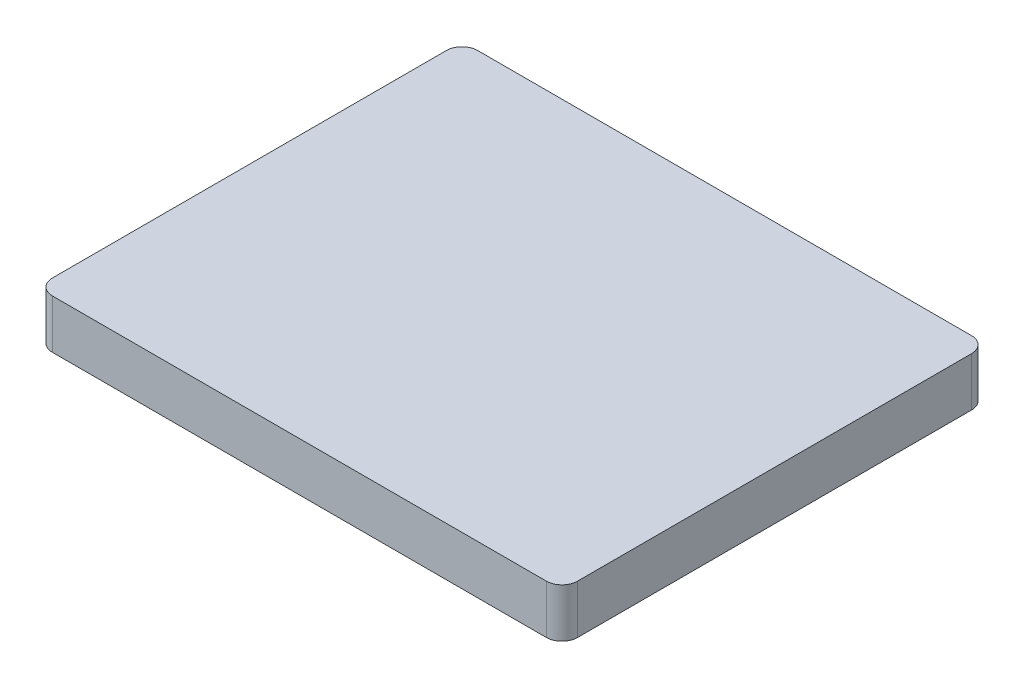
ISO-10303-21;
HEADER;
FILE_DESCRIPTION(('STEP AP214'),'2;1');
FILE_NAME('part.step','',(''),(''),'','','');
FILE_SCHEMA(('AUTOMOTIVE_DESIGN { 1 0 10303 214 1 1 1 1 }'));
ENDSEC;
DATA;
#1=APPLICATION_CONTEXT('core data for automotive mechanical design processes');
#2=APPLICATION_PROTOCOL_DEFINITION('international standard','automotive_design',2000,#1);
#3=PRODUCT_CONTEXT('',#1,'mechanical');
#4=PRODUCT('Part','Part','',(#3));
#5=PRODUCT_RELATED_PRODUCT_CATEGORY('part','',(#4));
#6=PRODUCT_DEFINITION_FORMATION('','',#4);
#7=PRODUCT_DEFINITION_CONTEXT('part definition',#1,'design');
#8=PRODUCT_DEFINITION('design','',#6,#7);
#9=PRODUCT_DEFINITION_SHAPE('','',#8);
#10=(LENGTH_UNIT() NAMED_UNIT(*) SI_UNIT(.MILLI.,.METRE.));
#11=(NAMED_UNIT(*) PLANE_ANGLE_UNIT() SI_UNIT($,.RADIAN.));
#12=(NAMED_UNIT(*) SI_UNIT($,.STERADIAN.) SOLID_ANGLE_UNIT());
#13=UNCERTAINTY_MEASURE_WITH_UNIT(LENGTH_MEASURE(1.E-05),#10,'distance_accuracy_value','');
#14=(GEOMETRIC_REPRESENTATION_CONTEXT(3) GLOBAL_UNCERTAINTY_ASSIGNED_CONTEXT((#13)) GLOBAL_UNIT_ASSIGNED_CONTEXT((#10,
#11,#12)) REPRESENTATION_CONTEXT('',''));
#15=CARTESIAN_POINT('',(0.,0.,0.));
#16=DIRECTION('',(0.,0.,1.));
#17=DIRECTION('',(1.,0.,0.));
#18=AXIS2_PLACEMENT_3D('',#15,#16,#17);
#19=CARTESIAN_POINT('',(10.875,17.7531010026189,8.375));
#20=DIRECTION('',(0.,1.,0.));
#21=DIRECTION('',(0.,0.,1.));
#22=AXIS2_PLACEMENT_3D('',#19,#20,#21);
#23=CYLINDRICAL_SURFACE('',#22,0.7);
#24=DIRECTION('',(0.,1.,0.));
#25=VECTOR('',#24,1.);
#26=CARTESIAN_POINT('',(10.875,17.7531010026189,9.075));
#27=LINE('',#26,#25);
#28=CARTESIAN_POINT('',(10.875,18.,9.075));
#29=VERTEX_POINT('',#28);
#30=CARTESIAN_POINT('',(10.875,20.2,9.075));
#31=VERTEX_POINT('',#30);
#32=EDGE_CURVE('E163',#29,#31,#27,.T.);
#33=ORIENTED_EDGE('',*,*,#32,.F.);
#34=CARTESIAN_POINT('',(10.875,18.,8.375));
#35=DIRECTION('',(0.,1.,0.));
#36=DIRECTION('',(0.,0.,1.));
#37=AXIS2_PLACEMENT_3D('',#34,#35,#36);
#38=CIRCLE('',#37,0.7);
#39=CARTESIAN_POINT('',(11.575,18.,8.375));
#40=VERTEX_POINT('',#39);
#41=EDGE_CURVE('E156',#29,#40,#38,.T.);
#42=ORIENTED_EDGE('',*,*,#41,.T.);
#43=DIRECTION('',(0.,1.,0.));
#44=VECTOR('',#43,1.);
#45=CARTESIAN_POINT('',(11.575,17.7531010026189,8.375));
#46=LINE('',#45,#44);
#47=CARTESIAN_POINT('',(11.575,20.2,8.375));
#48=VERTEX_POINT('',#47);
#49=EDGE_CURVE('E11',#40,#48,#46,.T.);
#50=ORIENTED_EDGE('',*,*,#49,.T.);
#51=CARTESIAN_POINT('',(10.875,20.2,8.375));
#52=DIRECTION('',(0.,1.,0.));
#53=DIRECTION('',(0.,0.,1.));
#54=AXIS2_PLACEMENT_3D('',#51,#52,#53);
#55=CIRCLE('',#54,0.7);
#56=EDGE_CURVE('E134',#48,#31,#55,.F.);
#57=ORIENTED_EDGE('',*,*,#56,.T.);
#58=EDGE_LOOP('',(#33,#42,#50,#57));
#59=FACE_BOUND('',#58,.T.);
#60=ADVANCED_FACE('F45',(#59),#23,.T.);
#61=CARTESIAN_POINT('',(-11.375,17.7531010026189,9.075));
#62=DIRECTION('',(0.,0.,1.));
#63=DIRECTION('',(1.,0.,0.));
#64=AXIS2_PLACEMENT_3D('',#61,#62,#63);
#65=PLANE('',#64);
#66=DIRECTION('',(0.,1.,0.));
#67=VECTOR('',#66,1.);
#68=CARTESIAN_POINT('',(-11.375,17.7531010026189,9.075));
#69=LINE('',#68,#67);
#70=CARTESIAN_POINT('',(-11.375,18.,9.075));
#71=VERTEX_POINT('',#70);
#72=CARTESIAN_POINT('',(-11.375,20.2,9.075));
#73=VERTEX_POINT('',#72);
#74=EDGE_CURVE('E166',#71,#73,#69,.T.);
#75=ORIENTED_EDGE('',*,*,#74,.F.);
#76=DIRECTION('',(1.,0.,0.));
#77=VECTOR('',#76,1.);
#78=CARTESIAN_POINT('',(0.,18.,9.075));
#79=LINE('',#78,#77);
#80=EDGE_CURVE('E152',#71,#29,#79,.T.);
#81=ORIENTED_EDGE('',*,*,#80,.T.);
#82=ORIENTED_EDGE('',*,*,#32,.T.);
#83=DIRECTION('',(-1.,0.,0.));
#84=VECTOR('',#83,1.);
#85=CARTESIAN_POINT('',(-0.25,20.2,9.075));
#86=LINE('',#85,#84);
#87=EDGE_CURVE('E138',#31,#73,#86,.T.);
#88=ORIENTED_EDGE('',*,*,#87,.T.);
#89=EDGE_LOOP('',(#75,#81,#82,#88));
#90=FACE_BOUND('',#89,.T.);
#91=ADVANCED_FACE('F220',(#90),#65,.T.);
#92=CARTESIAN_POINT('',(11.575,17.7531010026189,-9.375));
#93=DIRECTION('',(1.,0.,0.));
#94=DIRECTION('',(0.,0.,-1.));
#95=AXIS2_PLACEMENT_3D('',#92,#93,#94);
#96=PLANE('',#95);
#97=ORIENTED_EDGE('',*,*,#49,.F.);
#98=DIRECTION('',(0.,0.,-1.));
#99=VECTOR('',#98,1.);
#100=CARTESIAN_POINT('',(11.575,18.,0.));
#101=LINE('',#100,#99);
#102=CARTESIAN_POINT('',(11.575,18.,-9.375));
#103=VERTEX_POINT('',#102);
#104=EDGE_CURVE('E160',#40,#103,#101,.T.);
#105=ORIENTED_EDGE('',*,*,#104,.T.);
#106=DIRECTION('',(0.,1.,0.));
#107=VECTOR('',#106,1.);
#108=CARTESIAN_POINT('',(11.575,17.7531010026189,-9.375));
#109=LINE('',#108,#107);
#110=CARTESIAN_POINT('',(11.575,20.2,-9.375));
#111=VERTEX_POINT('',#110);
#112=EDGE_CURVE('E55',#103,#111,#109,.T.);
#113=ORIENTED_EDGE('',*,*,#112,.T.);
#114=DIRECTION('',(0.,0.,1.));
#115=VECTOR('',#114,1.);
#116=CARTESIAN_POINT('',(11.575,20.2,8.375));
#117=LINE('',#116,#115);
#118=EDGE_CURVE('E205',#111,#48,#117,.T.);
#119=ORIENTED_EDGE('',*,*,#118,.T.);
#120=EDGE_LOOP('',(#97,#105,#113,#119));
#121=FACE_BOUND('',#120,.T.);
#122=ADVANCED_FACE('F236',(#121),#96,.T.);
#123=CARTESIAN_POINT('',(10.875,17.7531010026189,-9.375));
#124=DIRECTION('',(0.,1.,0.));
#125=DIRECTION('',(0.,0.,1.));
#126=AXIS2_PLACEMENT_3D('',#123,#124,#125);
#127=CYLINDRICAL_SURFACE('',#126,0.699999999999999);
#128=ORIENTED_EDGE('',*,*,#112,.F.);
#129=CARTESIAN_POINT('',(10.875,18.,-9.375));
#130=DIRECTION('',(0.,1.,0.));
#131=DIRECTION('',(0.,0.,1.));
#132=AXIS2_PLACEMENT_3D('',#129,#130,#131);
#133=CIRCLE('',#132,0.699999999999999);
#134=CARTESIAN_POINT('',(10.875,18.,-10.075));
#135=VERTEX_POINT('',#134);
#136=EDGE_CURVE('E126',#103,#135,#133,.T.);
#137=ORIENTED_EDGE('',*,*,#136,.T.);
#138=DIRECTION('',(0.,1.,0.));
#139=VECTOR('',#138,1.);
#140=CARTESIAN_POINT('',(10.875,17.7531010026189,-10.075));
#141=LINE('',#140,#139);
#142=CARTESIAN_POINT('',(10.875,20.2,-10.075));
#143=VERTEX_POINT('',#142);
#144=EDGE_CURVE('E70',#135,#143,#141,.T.);
#145=ORIENTED_EDGE('',*,*,#144,.T.);
#146=CARTESIAN_POINT('',(10.875,20.2,-9.375));
#147=DIRECTION('',(0.,1.,0.));
#148=DIRECTION('',(0.,0.,1.));
#149=AXIS2_PLACEMENT_3D('',#146,#147,#148);
#150=CIRCLE('',#149,0.7);
#151=EDGE_CURVE('E120',#143,#111,#150,.F.);
#152=ORIENTED_EDGE('',*,*,#151,.T.);
#153=EDGE_LOOP('',(#128,#137,#145,#152));
#154=FACE_BOUND('',#153,.T.);
#155=ADVANCED_FACE('F132',(#154),#127,.T.);
#156=CARTESIAN_POINT('',(-12.075,17.7531010026189,-9.375));
#157=DIRECTION('',(-1.,0.,0.));
#158=DIRECTION('',(0.,0.,1.));
#159=AXIS2_PLACEMENT_3D('',#156,#157,#158);
#160=PLANE('',#159);
#161=DIRECTION('',(0.,1.,0.));
#162=VECTOR('',#161,1.);
#163=CARTESIAN_POINT('',(-12.075,17.7531010026189,-9.375));
#164=LINE('',#163,#162);
#165=CARTESIAN_POINT('',(-12.075,18.,-9.375));
#166=VERTEX_POINT('',#165);
#167=CARTESIAN_POINT('',(-12.075,20.2,-9.375));
#168=VERTEX_POINT('',#167);
#169=EDGE_CURVE('E175',#166,#168,#164,.T.);
#170=ORIENTED_EDGE('',*,*,#169,.F.);
#171=DIRECTION('',(0.,0.,1.));
#172=VECTOR('',#171,1.);
#173=CARTESIAN_POINT('',(-12.075,18.,0.));
#174=LINE('',#173,#172);
#175=CARTESIAN_POINT('',(-12.075,18.,8.375));
#176=VERTEX_POINT('',#175);
#177=EDGE_CURVE('E144',#166,#176,#174,.T.);
#178=ORIENTED_EDGE('',*,*,#177,.T.);
#179=DIRECTION('',(0.,1.,0.));
#180=VECTOR('',#179,1.);
#181=CARTESIAN_POINT('',(-12.075,17.7531010026189,8.375));
#182=LINE('',#181,#180);
#183=CARTESIAN_POINT('',(-12.075,20.2,8.375));
#184=VERTEX_POINT('',#183);
#185=EDGE_CURVE('E178',#176,#184,#182,.T.);
#186=ORIENTED_EDGE('',*,*,#185,.T.);
#187=DIRECTION('',(0.,0.,-1.));
#188=VECTOR('',#187,1.);
#189=CARTESIAN_POINT('',(-12.075,20.2,8.375));
#190=LINE('',#189,#188);
#191=EDGE_CURVE('E201',#184,#168,#190,.T.);
#192=ORIENTED_EDGE('',*,*,#191,.T.);
#193=EDGE_LOOP('',(#170,#178,#186,#192));
#194=FACE_BOUND('',#193,.T.);
#195=ADVANCED_FACE('F228',(#194),#160,.T.);
#196=CARTESIAN_POINT('',(-11.375,17.7531010026189,-9.375));
#197=DIRECTION('',(0.,1.,0.));
#198=DIRECTION('',(0.,0.,1.));
#199=AXIS2_PLACEMENT_3D('',#196,#197,#198);
#200=CYLINDRICAL_SURFACE('',#199,0.699999999999999);
#201=DIRECTION('',(0.,1.,0.));
#202=VECTOR('',#201,1.);
#203=CARTESIAN_POINT('',(-11.375,17.7531010026189,-10.075));
#204=LINE('',#203,#202);
#205=CARTESIAN_POINT('',(-11.375,18.,-10.075));
#206=VERTEX_POINT('',#205);
#207=CARTESIAN_POINT('',(-11.375,20.2,-10.075));
#208=VERTEX_POINT('',#207);
#209=EDGE_CURVE('E119',#206,#208,#204,.T.);
#210=ORIENTED_EDGE('',*,*,#209,.F.);
#211=CARTESIAN_POINT('',(-11.375,18.,-9.375));
#212=DIRECTION('',(0.,1.,0.));
#213=DIRECTION('',(0.,0.,1.));
#214=AXIS2_PLACEMENT_3D('',#211,#212,#213);
#215=CIRCLE('',#214,0.699999999999999);
#216=EDGE_CURVE('E129',#206,#166,#215,.T.);
#217=ORIENTED_EDGE('',*,*,#216,.T.);
#218=ORIENTED_EDGE('',*,*,#169,.T.);
#219=CARTESIAN_POINT('',(-11.375,20.2,-9.375));
#220=DIRECTION('',(0.,1.,0.));
#221=DIRECTION('',(0.,0.,1.));
#222=AXIS2_PLACEMENT_3D('',#219,#220,#221);
#223=CIRCLE('',#222,0.7);
#224=EDGE_CURVE('E194',#168,#208,#223,.F.);
#225=ORIENTED_EDGE('',*,*,#224,.T.);
#226=EDGE_LOOP('',(#210,#217,#218,#225));
#227=FACE_BOUND('',#226,.T.);
#228=ADVANCED_FACE('F195',(#227),#200,.T.);
#229=CARTESIAN_POINT('',(-11.375,17.7531010026189,8.375));
#230=DIRECTION('',(0.,1.,0.));
#231=DIRECTION('',(0.,0.,1.));
#232=AXIS2_PLACEMENT_3D('',#229,#230,#231);
#233=CYLINDRICAL_SURFACE('',#232,0.699999999999999);
#234=ORIENTED_EDGE('',*,*,#185,.F.);
#235=CARTESIAN_POINT('',(-11.375,18.,8.375));
#236=DIRECTION('',(0.,1.,0.));
#237=DIRECTION('',(0.,0.,1.));
#238=AXIS2_PLACEMENT_3D('',#235,#236,#237);
#239=CIRCLE('',#238,0.699999999999999);
#240=EDGE_CURVE('E148',#176,#71,#239,.T.);
#241=ORIENTED_EDGE('',*,*,#240,.T.);
#242=ORIENTED_EDGE('',*,*,#74,.T.);
#243=CARTESIAN_POINT('',(-11.375,20.2,8.375));
#244=DIRECTION('',(0.,1.,0.));
#245=DIRECTION('',(0.,0.,1.));
#246=AXIS2_PLACEMENT_3D('',#243,#244,#245);
#247=CIRCLE('',#246,0.7);
#248=EDGE_CURVE('E200',#73,#184,#247,.F.);
#249=ORIENTED_EDGE('',*,*,#248,.T.);
#250=EDGE_LOOP('',(#234,#241,#242,#249));
#251=FACE_BOUND('',#250,.T.);
#252=ADVANCED_FACE('F224',(#251),#233,.T.);
#253=CARTESIAN_POINT('',(-11.375,17.7531010026189,-10.075));
#254=DIRECTION('',(0.,0.,-1.));
#255=DIRECTION('',(-1.,0.,0.));
#256=AXIS2_PLACEMENT_3D('',#253,#254,#255);
#257=PLANE('',#256);
#258=ORIENTED_EDGE('',*,*,#144,.F.);
#259=DIRECTION('',(-1.,0.,0.));
#260=VECTOR('',#259,1.);
#261=CARTESIAN_POINT('',(0.,18.,-10.075));
#262=LINE('',#261,#260);
#263=EDGE_CURVE('E114',#135,#206,#262,.T.);
#264=ORIENTED_EDGE('',*,*,#263,.T.);
#265=ORIENTED_EDGE('',*,*,#209,.T.);
#266=DIRECTION('',(1.,0.,0.));
#267=VECTOR('',#266,1.);
#268=CARTESIAN_POINT('',(-0.25,20.2,-10.075));
#269=LINE('',#268,#267);
#270=EDGE_CURVE('E116',#208,#143,#269,.T.);
#271=ORIENTED_EDGE('',*,*,#270,.T.);
#272=EDGE_LOOP('',(#258,#264,#265,#271));
#273=FACE_BOUND('',#272,.T.);
#274=ADVANCED_FACE('F113',(#273),#257,.T.);
#275=CARTESIAN_POINT('',(0.,20.2,0.));
#276=DIRECTION('',(0.,1.,0.));
#277=DIRECTION('',(0.,0.,1.));
#278=AXIS2_PLACEMENT_3D('',#275,#276,#277);
#279=PLANE('',#278);
#280=ORIENTED_EDGE('',*,*,#270,.F.);
#281=ORIENTED_EDGE('',*,*,#224,.F.);
#282=ORIENTED_EDGE('',*,*,#191,.F.);
#283=ORIENTED_EDGE('',*,*,#248,.F.);
#284=ORIENTED_EDGE('',*,*,#87,.F.);
#285=ORIENTED_EDGE('',*,*,#56,.F.);
#286=ORIENTED_EDGE('',*,*,#118,.F.);
#287=ORIENTED_EDGE('',*,*,#151,.F.);
#288=EDGE_LOOP('',(#280,#281,#282,#283,#284,#285,#286,#287));
#289=FACE_BOUND('',#288,.T.);
#290=ADVANCED_FACE('F203',(#289),#279,.T.);
#291=CARTESIAN_POINT('',(0.,18.,0.));
#292=DIRECTION('',(0.,1.,0.));
#293=DIRECTION('',(1.,0.,0.));
#294=AXIS2_PLACEMENT_3D('',#291,#292,#293);
#295=PLANE('',#294);
#296=ORIENTED_EDGE('',*,*,#136,.F.);
#297=ORIENTED_EDGE('',*,*,#104,.F.);
#298=ORIENTED_EDGE('',*,*,#41,.F.);
#299=ORIENTED_EDGE('',*,*,#80,.F.);
#300=ORIENTED_EDGE('',*,*,#240,.F.);
#301=ORIENTED_EDGE('',*,*,#177,.F.);
#302=ORIENTED_EDGE('',*,*,#216,.F.);
#303=ORIENTED_EDGE('',*,*,#263,.F.);
#304=EDGE_LOOP('',(#296,#297,#298,#299,#300,#301,#302,#303));
#305=FACE_BOUND('',#304,.T.);
#306=ADVANCED_FACE('F47',(#305),#295,.F.);
#307=CLOSED_SHELL('',(#60,#91,#122,#155,#195,#228,#252,#274,#290,#306));
#308=MANIFOLD_SOLID_BREP('B2',#307);
#309=ADVANCED_BREP_SHAPE_REPRESENTATION('',(#18,#308),#14);
#310=SHAPE_DEFINITION_REPRESENTATION(#9,#309);
ENDSEC;
END-ISO-10303-21;
